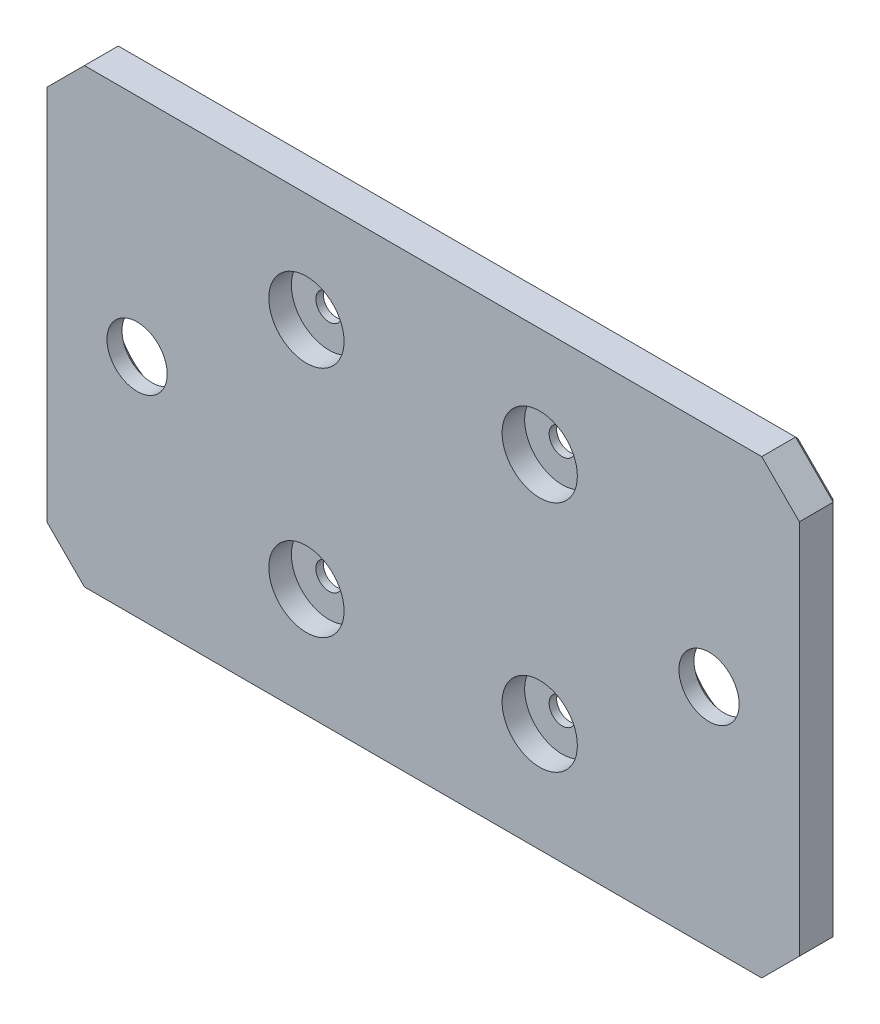
ISO-10303-21;
HEADER;
FILE_DESCRIPTION(('STEP AP214'),'2;1');
FILE_NAME('part.step','',(''),(''),'','','');
FILE_SCHEMA(('AUTOMOTIVE_DESIGN { 1 0 10303 214 1 1 1 1 }'));
ENDSEC;
DATA;
#1=APPLICATION_CONTEXT('core data for automotive mechanical design processes');
#2=APPLICATION_PROTOCOL_DEFINITION('international standard','automotive_design',2000,#1);
#3=PRODUCT_CONTEXT('',#1,'mechanical');
#4=PRODUCT('Part','Part','',(#3));
#5=PRODUCT_RELATED_PRODUCT_CATEGORY('part','',(#4));
#6=PRODUCT_DEFINITION_FORMATION('','',#4);
#7=PRODUCT_DEFINITION_CONTEXT('part definition',#1,'design');
#8=PRODUCT_DEFINITION('design','',#6,#7);
#9=PRODUCT_DEFINITION_SHAPE('','',#8);
#10=(LENGTH_UNIT() NAMED_UNIT(*) SI_UNIT(.MILLI.,.METRE.));
#11=(NAMED_UNIT(*) PLANE_ANGLE_UNIT() SI_UNIT($,.RADIAN.));
#12=(NAMED_UNIT(*) SI_UNIT($,.STERADIAN.) SOLID_ANGLE_UNIT());
#13=UNCERTAINTY_MEASURE_WITH_UNIT(LENGTH_MEASURE(1.E-05),#10,'distance_accuracy_value','');
#14=(GEOMETRIC_REPRESENTATION_CONTEXT(3) GLOBAL_UNCERTAINTY_ASSIGNED_CONTEXT((#13)) GLOBAL_UNIT_ASSIGNED_CONTEXT((#10,
#11,#12)) REPRESENTATION_CONTEXT('',''));
#15=CARTESIAN_POINT('',(0.,0.,0.));
#16=DIRECTION('',(0.,0.,1.));
#17=DIRECTION('',(1.,0.,0.));
#18=AXIS2_PLACEMENT_3D('',#15,#16,#17);
#19=CARTESIAN_POINT('',(-38.,0.,5.));
#20=DIRECTION('',(0.,0.,-1.));
#21=DIRECTION('',(-1.,0.,0.));
#22=AXIS2_PLACEMENT_3D('',#19,#20,#21);
#23=CYLINDRICAL_SURFACE('',#22,4.);
#24=CARTESIAN_POINT('',(-38.,0.,5.));
#25=DIRECTION('',(0.,0.,-1.));
#26=DIRECTION('',(-1.,0.,0.));
#27=AXIS2_PLACEMENT_3D('',#24,#25,#26);
#28=CIRCLE('',#27,4.);
#29=CARTESIAN_POINT('',(-42.,0.,5.));
#30=VERTEX_POINT('',#29);
#31=EDGE_CURVE('E234',#30,#30,#28,.T.);
#32=ORIENTED_EDGE('',*,*,#31,.F.);
#33=EDGE_LOOP('',(#32));
#34=FACE_BOUND('',#33,.T.);
#35=CARTESIAN_POINT('',(-38.,0.,3.));
#36=DIRECTION('',(0.,0.,-1.));
#37=DIRECTION('',(-1.,0.,0.));
#38=AXIS2_PLACEMENT_3D('',#35,#36,#37);
#39=CIRCLE('',#38,4.);
#40=CARTESIAN_POINT('',(-42.,0.,3.));
#41=VERTEX_POINT('',#40);
#42=EDGE_CURVE('E230',#41,#41,#39,.F.);
#43=ORIENTED_EDGE('',*,*,#42,.F.);
#44=EDGE_LOOP('',(#43));
#45=FACE_BOUND('',#44,.T.);
#46=ADVANCED_FACE('F39',(#34,#45),#23,.F.);
#47=CARTESIAN_POINT('',(38.,0.,5.));
#48=DIRECTION('',(0.,0.,-1.));
#49=DIRECTION('',(-1.,0.,0.));
#50=AXIS2_PLACEMENT_3D('',#47,#48,#49);
#51=CYLINDRICAL_SURFACE('',#50,4.00000000000001);
#52=CARTESIAN_POINT('',(38.,0.,5.));
#53=DIRECTION('',(0.,0.,-1.));
#54=DIRECTION('',(-1.,0.,0.));
#55=AXIS2_PLACEMENT_3D('',#52,#53,#54);
#56=CIRCLE('',#55,4.00000000000001);
#57=CARTESIAN_POINT('',(34.,0.,5.));
#58=VERTEX_POINT('',#57);
#59=EDGE_CURVE('E337',#58,#58,#56,.T.);
#60=ORIENTED_EDGE('',*,*,#59,.F.);
#61=EDGE_LOOP('',(#60));
#62=FACE_BOUND('',#61,.T.);
#63=CARTESIAN_POINT('',(38.,0.,3.));
#64=DIRECTION('',(0.,0.,-1.));
#65=DIRECTION('',(-1.,0.,0.));
#66=AXIS2_PLACEMENT_3D('',#63,#64,#65);
#67=CIRCLE('',#66,4.00000000000001);
#68=CARTESIAN_POINT('',(34.,0.,3.));
#69=VERTEX_POINT('',#68);
#70=EDGE_CURVE('E227',#69,#69,#67,.F.);
#71=ORIENTED_EDGE('',*,*,#70,.F.);
#72=EDGE_LOOP('',(#71));
#73=FACE_BOUND('',#72,.T.);
#74=ADVANCED_FACE('F408',(#62,#73),#51,.F.);
#75=CARTESIAN_POINT('',(-15.5,15.499999999999,-49.));
#76=DIRECTION('',(0.,0.,1.));
#77=DIRECTION('',(1.,0.,0.));
#78=AXIS2_PLACEMENT_3D('',#75,#76,#77);
#79=CYLINDRICAL_SURFACE('',#78,1.75);
#80=CARTESIAN_POINT('',(-15.5,15.499999999999,1.));
#81=DIRECTION('',(0.,0.,-1.));
#82=DIRECTION('',(-1.,0.,0.));
#83=AXIS2_PLACEMENT_3D('',#80,#81,#82);
#84=CIRCLE('',#83,1.75);
#85=CARTESIAN_POINT('',(-17.25,15.499999999999,1.));
#86=VERTEX_POINT('',#85);
#87=EDGE_CURVE('E197',#86,#86,#84,.T.);
#88=ORIENTED_EDGE('',*,*,#87,.T.);
#89=EDGE_LOOP('',(#88));
#90=FACE_BOUND('',#89,.T.);
#91=CARTESIAN_POINT('',(-15.5,15.499999999999,2.));
#92=DIRECTION('',(0.,0.,1.));
#93=DIRECTION('',(1.,0.,0.));
#94=AXIS2_PLACEMENT_3D('',#91,#92,#93);
#95=CIRCLE('',#94,1.75);
#96=CARTESIAN_POINT('',(-13.75,15.499999999999,2.));
#97=VERTEX_POINT('',#96);
#98=EDGE_CURVE('E202',#97,#97,#95,.F.);
#99=ORIENTED_EDGE('',*,*,#98,.F.);
#100=EDGE_LOOP('',(#99));
#101=FACE_BOUND('',#100,.T.);
#102=ADVANCED_FACE('F414',(#90,#101),#79,.F.);
#103=CARTESIAN_POINT('',(15.5,15.5,-49.));
#104=DIRECTION('',(0.,0.,1.));
#105=DIRECTION('',(1.,0.,0.));
#106=AXIS2_PLACEMENT_3D('',#103,#104,#105);
#107=CYLINDRICAL_SURFACE('',#106,1.75);
#108=CARTESIAN_POINT('',(15.5,15.5,1.));
#109=DIRECTION('',(0.,0.,-1.));
#110=DIRECTION('',(-1.,0.,0.));
#111=AXIS2_PLACEMENT_3D('',#108,#109,#110);
#112=CIRCLE('',#111,1.75);
#113=CARTESIAN_POINT('',(13.75,15.5,1.));
#114=VERTEX_POINT('',#113);
#115=EDGE_CURVE('E201',#114,#114,#112,.T.);
#116=ORIENTED_EDGE('',*,*,#115,.T.);
#117=EDGE_LOOP('',(#116));
#118=FACE_BOUND('',#117,.T.);
#119=CARTESIAN_POINT('',(15.5,15.5,2.));
#120=DIRECTION('',(0.,0.,1.));
#121=DIRECTION('',(1.,0.,0.));
#122=AXIS2_PLACEMENT_3D('',#119,#120,#121);
#123=CIRCLE('',#122,1.75);
#124=CARTESIAN_POINT('',(17.25,15.5,2.));
#125=VERTEX_POINT('',#124);
#126=EDGE_CURVE('E221',#125,#125,#123,.F.);
#127=ORIENTED_EDGE('',*,*,#126,.F.);
#128=EDGE_LOOP('',(#127));
#129=FACE_BOUND('',#128,.T.);
#130=ADVANCED_FACE('F454',(#118,#129),#107,.F.);
#131=CARTESIAN_POINT('',(15.4999999992762,-15.4999999996144,-49.));
#132=DIRECTION('',(0.,0.,1.));
#133=DIRECTION('',(1.,0.,0.));
#134=AXIS2_PLACEMENT_3D('',#131,#132,#133);
#135=CYLINDRICAL_SURFACE('',#134,1.75);
#136=CARTESIAN_POINT('',(15.4999999992762,-15.4999999996144,1.));
#137=DIRECTION('',(0.,0.,-1.));
#138=DIRECTION('',(-1.,0.,0.));
#139=AXIS2_PLACEMENT_3D('',#136,#137,#138);
#140=CIRCLE('',#139,1.75);
#141=CARTESIAN_POINT('',(13.7499999992762,-15.4999999996144,1.));
#142=VERTEX_POINT('',#141);
#143=EDGE_CURVE('E205',#142,#142,#140,.T.);
#144=ORIENTED_EDGE('',*,*,#143,.T.);
#145=EDGE_LOOP('',(#144));
#146=FACE_BOUND('',#145,.T.);
#147=CARTESIAN_POINT('',(15.4999999992762,-15.4999999996144,2.));
#148=DIRECTION('',(0.,0.,1.));
#149=DIRECTION('',(1.,0.,0.));
#150=AXIS2_PLACEMENT_3D('',#147,#148,#149);
#151=CIRCLE('',#150,1.75);
#152=CARTESIAN_POINT('',(17.2499999992762,-15.4999999996144,2.));
#153=VERTEX_POINT('',#152);
#154=EDGE_CURVE('E217',#153,#153,#151,.F.);
#155=ORIENTED_EDGE('',*,*,#154,.F.);
#156=EDGE_LOOP('',(#155));
#157=FACE_BOUND('',#156,.T.);
#158=ADVANCED_FACE('F401',(#146,#157),#135,.F.);
#159=CARTESIAN_POINT('',(-15.499999999999,-15.500000000001,-49.));
#160=DIRECTION('',(0.,0.,1.));
#161=DIRECTION('',(1.,0.,0.));
#162=AXIS2_PLACEMENT_3D('',#159,#160,#161);
#163=CYLINDRICAL_SURFACE('',#162,1.75);
#164=CARTESIAN_POINT('',(-15.499999999999,-15.500000000001,1.));
#165=DIRECTION('',(0.,0.,-1.));
#166=DIRECTION('',(-1.,0.,0.));
#167=AXIS2_PLACEMENT_3D('',#164,#165,#166);
#168=CIRCLE('',#167,1.75);
#169=CARTESIAN_POINT('',(-17.249999999999,-15.500000000001,1.));
#170=VERTEX_POINT('',#169);
#171=EDGE_CURVE('E208',#170,#170,#168,.T.);
#172=ORIENTED_EDGE('',*,*,#171,.T.);
#173=EDGE_LOOP('',(#172));
#174=FACE_BOUND('',#173,.T.);
#175=CARTESIAN_POINT('',(-15.499999999999,-15.500000000001,2.));
#176=DIRECTION('',(0.,0.,1.));
#177=DIRECTION('',(1.,0.,0.));
#178=AXIS2_PLACEMENT_3D('',#175,#176,#177);
#179=CIRCLE('',#178,1.75);
#180=CARTESIAN_POINT('',(-13.749999999999,-15.500000000001,2.));
#181=VERTEX_POINT('',#180);
#182=EDGE_CURVE('E213',#181,#181,#179,.F.);
#183=ORIENTED_EDGE('',*,*,#182,.F.);
#184=EDGE_LOOP('',(#183));
#185=FACE_BOUND('',#184,.T.);
#186=ADVANCED_FACE('F391',(#174,#185),#163,.F.);
#187=CARTESIAN_POINT('',(0.,0.,0.));
#188=DIRECTION('',(0.,0.,-1.));
#189=DIRECTION('',(-1.,0.,0.));
#190=AXIS2_PLACEMENT_3D('',#187,#188,#189);
#191=PLANE('',#190);
#192=DIRECTION('',(-1.,0.,0.));
#193=VECTOR('',#192,1.);
#194=CARTESIAN_POINT('',(-45.,-29.5,0.));
#195=LINE('',#194,#193);
#196=CARTESIAN_POINT('',(44.7928932188134,-29.5,0.));
#197=VERTEX_POINT('',#196);
#198=CARTESIAN_POINT('',(-44.7928932188135,-29.5,0.));
#199=VERTEX_POINT('',#198);
#200=EDGE_CURVE('E272',#197,#199,#195,.T.);
#201=ORIENTED_EDGE('',*,*,#200,.T.);
#202=DIRECTION('',(-0.707106781186547,0.707106781186549,0.));
#203=VECTOR('',#202,1.);
#204=CARTESIAN_POINT('',(-37.1464466094068,-37.1464466094067,0.));
#205=LINE('',#204,#203);
#206=CARTESIAN_POINT('',(-49.5,-24.7928932188135,0.));
#207=VERTEX_POINT('',#206);
#208=EDGE_CURVE('E286',#199,#207,#205,.T.);
#209=ORIENTED_EDGE('',*,*,#208,.T.);
#210=DIRECTION('',(0.,1.,0.));
#211=VECTOR('',#210,1.);
#212=CARTESIAN_POINT('',(-49.5,25.,0.));
#213=LINE('',#212,#211);
#214=CARTESIAN_POINT('',(-49.5,24.7928932188134,0.));
#215=VERTEX_POINT('',#214);
#216=EDGE_CURVE('E284',#207,#215,#213,.T.);
#217=ORIENTED_EDGE('',*,*,#216,.T.);
#218=DIRECTION('',(0.70710678118655,0.707106781186546,0.));
#219=VECTOR('',#218,1.);
#220=CARTESIAN_POINT('',(-37.1464466094066,37.1464466094068,0.));
#221=LINE('',#220,#219);
#222=CARTESIAN_POINT('',(-44.7928932188134,29.5,0.));
#223=VERTEX_POINT('',#222);
#224=EDGE_CURVE('E282',#215,#223,#221,.T.);
#225=ORIENTED_EDGE('',*,*,#224,.T.);
#226=DIRECTION('',(1.,0.,0.));
#227=VECTOR('',#226,1.);
#228=CARTESIAN_POINT('',(45.,29.5,0.));
#229=LINE('',#228,#227);
#230=CARTESIAN_POINT('',(44.7928932188135,29.5,0.));
#231=VERTEX_POINT('',#230);
#232=EDGE_CURVE('E280',#223,#231,#229,.T.);
#233=ORIENTED_EDGE('',*,*,#232,.T.);
#234=DIRECTION('',(0.707106781186547,-0.707106781186549,0.));
#235=VECTOR('',#234,1.);
#236=CARTESIAN_POINT('',(37.1464466094068,37.1464466094067,0.));
#237=LINE('',#236,#235);
#238=CARTESIAN_POINT('',(49.5,24.7928932188134,0.));
#239=VERTEX_POINT('',#238);
#240=EDGE_CURVE('E278',#231,#239,#237,.T.);
#241=ORIENTED_EDGE('',*,*,#240,.T.);
#242=DIRECTION('',(0.,-1.,0.));
#243=VECTOR('',#242,1.);
#244=CARTESIAN_POINT('',(49.5,-25.,0.));
#245=LINE('',#244,#243);
#246=CARTESIAN_POINT('',(49.5,-24.7928932188135,0.));
#247=VERTEX_POINT('',#246);
#248=EDGE_CURVE('E276',#239,#247,#245,.T.);
#249=ORIENTED_EDGE('',*,*,#248,.T.);
#250=DIRECTION('',(-0.70710678118655,-0.707106781186546,0.));
#251=VECTOR('',#250,1.);
#252=CARTESIAN_POINT('',(37.1464466094066,-37.1464466094068,0.));
#253=LINE('',#252,#251);
#254=EDGE_CURVE('E274',#247,#197,#253,.T.);
#255=ORIENTED_EDGE('',*,*,#254,.T.);
#256=EDGE_LOOP('',(#201,#209,#217,#225,#233,#241,#249,#255));
#257=FACE_BOUND('',#256,.T.);
#258=CARTESIAN_POINT('',(-38.,0.,0.));
#259=DIRECTION('',(0.,0.,-1.));
#260=DIRECTION('',(-1.,0.,0.));
#261=AXIS2_PLACEMENT_3D('',#258,#259,#260);
#262=CIRCLE('',#261,8.00000000000002);
#263=CARTESIAN_POINT('',(-46.,0.,0.));
#264=VERTEX_POINT('',#263);
#265=EDGE_CURVE('E240',#264,#264,#262,.F.);
#266=ORIENTED_EDGE('',*,*,#265,.T.);
#267=EDGE_LOOP('',(#266));
#268=FACE_BOUND('',#267,.T.);
#269=CARTESIAN_POINT('',(38.,0.,0.));
#270=DIRECTION('',(0.,0.,-1.));
#271=DIRECTION('',(-1.,0.,0.));
#272=AXIS2_PLACEMENT_3D('',#269,#270,#271);
#273=CIRCLE('',#272,8.00000000000002);
#274=CARTESIAN_POINT('',(30.,0.,0.));
#275=VERTEX_POINT('',#274);
#276=EDGE_CURVE('E237',#275,#275,#273,.F.);
#277=ORIENTED_EDGE('',*,*,#276,.T.);
#278=EDGE_LOOP('',(#277));
#279=FACE_BOUND('',#278,.T.);
#280=DIRECTION('',(-1.,0.,0.));
#281=VECTOR('',#280,1.);
#282=CARTESIAN_POINT('',(21.75,21.75,0.));
#283=LINE('',#282,#281);
#284=CARTESIAN_POINT('',(21.75,21.75,0.));
#285=VERTEX_POINT('',#284);
#286=CARTESIAN_POINT('',(-21.75,21.75,0.));
#287=VERTEX_POINT('',#286);
#288=EDGE_CURVE('E173',#285,#287,#283,.T.);
#289=ORIENTED_EDGE('',*,*,#288,.T.);
#290=DIRECTION('',(0.,-1.,0.));
#291=VECTOR('',#290,1.);
#292=CARTESIAN_POINT('',(-21.75,21.75,0.));
#293=LINE('',#292,#291);
#294=CARTESIAN_POINT('',(-21.75,-21.75,0.));
#295=VERTEX_POINT('',#294);
#296=EDGE_CURVE('E212',#287,#295,#293,.T.);
#297=ORIENTED_EDGE('',*,*,#296,.T.);
#298=DIRECTION('',(1.,0.,0.));
#299=VECTOR('',#298,1.);
#300=CARTESIAN_POINT('',(21.75,-21.75,0.));
#301=LINE('',#300,#299);
#302=CARTESIAN_POINT('',(21.75,-21.75,0.));
#303=VERTEX_POINT('',#302);
#304=EDGE_CURVE('E177',#295,#303,#301,.T.);
#305=ORIENTED_EDGE('',*,*,#304,.T.);
#306=DIRECTION('',(0.,1.,0.));
#307=VECTOR('',#306,1.);
#308=CARTESIAN_POINT('',(21.75,21.75,0.));
#309=LINE('',#308,#307);
#310=EDGE_CURVE('E375',#303,#285,#309,.T.);
#311=ORIENTED_EDGE('',*,*,#310,.T.);
#312=EDGE_LOOP('',(#289,#297,#305,#311));
#313=FACE_BOUND('',#312,.T.);
#314=ADVANCED_FACE('F388',(#257,#268,#279,#313),#191,.T.);
#315=CARTESIAN_POINT('',(50.,-30.,5.));
#316=DIRECTION('',(-1.,0.,0.));
#317=DIRECTION('',(0.,0.,1.));
#318=AXIS2_PLACEMENT_3D('',#315,#316,#317);
#319=PLANE('',#318);
#320=DIRECTION('',(0.,0.,-1.));
#321=VECTOR('',#320,1.);
#322=CARTESIAN_POINT('',(50.,-25.,5.));
#323=LINE('',#322,#321);
#324=CARTESIAN_POINT('',(50.,-25.,5.));
#325=VERTEX_POINT('',#324);
#326=CARTESIAN_POINT('',(50.,-25.,0.500000000000013));
#327=VERTEX_POINT('',#326);
#328=EDGE_CURVE('E251',#325,#327,#323,.T.);
#329=ORIENTED_EDGE('',*,*,#328,.T.);
#330=DIRECTION('',(0.,1.,0.));
#331=VECTOR('',#330,1.);
#332=CARTESIAN_POINT('',(50.,25.,0.500000000000014));
#333=LINE('',#332,#331);
#334=CARTESIAN_POINT('',(50.,25.,0.500000000000014));
#335=VERTEX_POINT('',#334);
#336=EDGE_CURVE('E300',#327,#335,#333,.T.);
#337=ORIENTED_EDGE('',*,*,#336,.T.);
#338=DIRECTION('',(0.,0.,1.));
#339=VECTOR('',#338,1.);
#340=CARTESIAN_POINT('',(50.,25.,5.));
#341=LINE('',#340,#339);
#342=CARTESIAN_POINT('',(50.,25.,5.));
#343=VERTEX_POINT('',#342);
#344=EDGE_CURVE('E253',#335,#343,#341,.T.);
#345=ORIENTED_EDGE('',*,*,#344,.T.);
#346=DIRECTION('',(0.,1.,0.));
#347=VECTOR('',#346,1.);
#348=CARTESIAN_POINT('',(50.,-30.,5.));
#349=LINE('',#348,#347);
#350=EDGE_CURVE('E178',#325,#343,#349,.T.);
#351=ORIENTED_EDGE('',*,*,#350,.F.);
#352=EDGE_LOOP('',(#329,#337,#345,#351));
#353=FACE_BOUND('',#352,.T.);
#354=ADVANCED_FACE('F390',(#353),#319,.F.);
#355=CARTESIAN_POINT('',(-50.,30.,5.));
#356=DIRECTION('',(0.,-1.,0.));
#357=DIRECTION('',(0.,0.,-1.));
#358=AXIS2_PLACEMENT_3D('',#355,#356,#357);
#359=PLANE('',#358);
#360=DIRECTION('',(0.,0.,-1.));
#361=VECTOR('',#360,1.);
#362=CARTESIAN_POINT('',(45.,30.,5.));
#363=LINE('',#362,#361);
#364=CARTESIAN_POINT('',(45.,30.,5.));
#365=VERTEX_POINT('',#364);
#366=CARTESIAN_POINT('',(45.,30.,0.500000000000015));
#367=VERTEX_POINT('',#366);
#368=EDGE_CURVE('E248',#365,#367,#363,.T.);
#369=ORIENTED_EDGE('',*,*,#368,.T.);
#370=DIRECTION('',(-1.,0.,0.));
#371=VECTOR('',#370,1.);
#372=CARTESIAN_POINT('',(-45.,30.,0.500000000000014));
#373=LINE('',#372,#371);
#374=CARTESIAN_POINT('',(-45.,30.,0.500000000000014));
#375=VERTEX_POINT('',#374);
#376=EDGE_CURVE('E296',#367,#375,#373,.T.);
#377=ORIENTED_EDGE('',*,*,#376,.T.);
#378=DIRECTION('',(0.,0.,1.));
#379=VECTOR('',#378,1.);
#380=CARTESIAN_POINT('',(-45.,30.,5.));
#381=LINE('',#380,#379);
#382=CARTESIAN_POINT('',(-45.,30.,5.));
#383=VERTEX_POINT('',#382);
#384=EDGE_CURVE('E246',#375,#383,#381,.T.);
#385=ORIENTED_EDGE('',*,*,#384,.T.);
#386=DIRECTION('',(-1.,0.,0.));
#387=VECTOR('',#386,1.);
#388=CARTESIAN_POINT('',(-50.,30.,5.));
#389=LINE('',#388,#387);
#390=EDGE_CURVE('E182',#365,#383,#389,.T.);
#391=ORIENTED_EDGE('',*,*,#390,.F.);
#392=EDGE_LOOP('',(#369,#377,#385,#391));
#393=FACE_BOUND('',#392,.T.);
#394=ADVANCED_FACE('F398',(#393),#359,.F.);
#395=CARTESIAN_POINT('',(-50.,-30.,5.));
#396=DIRECTION('',(1.,0.,0.));
#397=DIRECTION('',(0.,0.,-1.));
#398=AXIS2_PLACEMENT_3D('',#395,#396,#397);
#399=PLANE('',#398);
#400=DIRECTION('',(0.,0.,-1.));
#401=VECTOR('',#400,1.);
#402=CARTESIAN_POINT('',(-50.,25.,5.));
#403=LINE('',#402,#401);
#404=CARTESIAN_POINT('',(-50.,25.,5.));
#405=VERTEX_POINT('',#404);
#406=CARTESIAN_POINT('',(-50.,25.,0.500000000000013));
#407=VERTEX_POINT('',#406);
#408=EDGE_CURVE('E265',#405,#407,#403,.T.);
#409=ORIENTED_EDGE('',*,*,#408,.T.);
#410=DIRECTION('',(0.,-1.,0.));
#411=VECTOR('',#410,1.);
#412=CARTESIAN_POINT('',(-50.,-25.,0.500000000000014));
#413=LINE('',#412,#411);
#414=CARTESIAN_POINT('',(-50.,-25.,0.500000000000014));
#415=VERTEX_POINT('',#414);
#416=EDGE_CURVE('E292',#407,#415,#413,.T.);
#417=ORIENTED_EDGE('',*,*,#416,.T.);
#418=DIRECTION('',(0.,0.,1.));
#419=VECTOR('',#418,1.);
#420=CARTESIAN_POINT('',(-50.,-25.,5.));
#421=LINE('',#420,#419);
#422=CARTESIAN_POINT('',(-50.,-25.,5.));
#423=VERTEX_POINT('',#422);
#424=EDGE_CURVE('E263',#415,#423,#421,.T.);
#425=ORIENTED_EDGE('',*,*,#424,.T.);
#426=DIRECTION('',(0.,-1.,0.));
#427=VECTOR('',#426,1.);
#428=CARTESIAN_POINT('',(-50.,-30.,5.));
#429=LINE('',#428,#427);
#430=EDGE_CURVE('E190',#405,#423,#429,.T.);
#431=ORIENTED_EDGE('',*,*,#430,.F.);
#432=EDGE_LOOP('',(#409,#417,#425,#431));
#433=FACE_BOUND('',#432,.T.);
#434=ADVANCED_FACE('F481',(#433),#399,.F.);
#435=CARTESIAN_POINT('',(-50.,-30.,5.));
#436=DIRECTION('',(0.,1.,0.));
#437=DIRECTION('',(0.,0.,1.));
#438=AXIS2_PLACEMENT_3D('',#435,#436,#437);
#439=PLANE('',#438);
#440=DIRECTION('',(0.,0.,-1.));
#441=VECTOR('',#440,1.);
#442=CARTESIAN_POINT('',(-45.,-30.,5.));
#443=LINE('',#442,#441);
#444=CARTESIAN_POINT('',(-45.,-30.,5.));
#445=VERTEX_POINT('',#444);
#446=CARTESIAN_POINT('',(-45.,-30.,0.500000000000014));
#447=VERTEX_POINT('',#446);
#448=EDGE_CURVE('E270',#445,#447,#443,.T.);
#449=ORIENTED_EDGE('',*,*,#448,.T.);
#450=DIRECTION('',(1.,0.,0.));
#451=VECTOR('',#450,1.);
#452=CARTESIAN_POINT('',(45.,-30.,0.500000000000014));
#453=LINE('',#452,#451);
#454=CARTESIAN_POINT('',(45.,-30.,0.500000000000014));
#455=VERTEX_POINT('',#454);
#456=EDGE_CURVE('E11',#447,#455,#453,.T.);
#457=ORIENTED_EDGE('',*,*,#456,.T.);
#458=DIRECTION('',(0.,0.,1.));
#459=VECTOR('',#458,1.);
#460=CARTESIAN_POINT('',(45.,-30.,5.));
#461=LINE('',#460,#459);
#462=CARTESIAN_POINT('',(45.,-30.,5.));
#463=VERTEX_POINT('',#462);
#464=EDGE_CURVE('E268',#455,#463,#461,.T.);
#465=ORIENTED_EDGE('',*,*,#464,.T.);
#466=DIRECTION('',(1.,0.,0.));
#467=VECTOR('',#466,1.);
#468=CARTESIAN_POINT('',(-50.,-30.,5.));
#469=LINE('',#468,#467);
#470=EDGE_CURVE('E193',#445,#463,#469,.T.);
#471=ORIENTED_EDGE('',*,*,#470,.F.);
#472=EDGE_LOOP('',(#449,#457,#465,#471));
#473=FACE_BOUND('',#472,.T.);
#474=ADVANCED_FACE('F476',(#473),#439,.F.);
#475=CARTESIAN_POINT('',(0.,0.,5.));
#476=DIRECTION('',(0.,0.,-1.));
#477=DIRECTION('',(-1.,0.,0.));
#478=AXIS2_PLACEMENT_3D('',#475,#476,#477);
#479=PLANE('',#478);
#480=ORIENTED_EDGE('',*,*,#59,.T.);
#481=EDGE_LOOP('',(#480));
#482=FACE_BOUND('',#481,.T.);
#483=ORIENTED_EDGE('',*,*,#31,.T.);
#484=EDGE_LOOP('',(#483));
#485=FACE_BOUND('',#484,.T.);
#486=CARTESIAN_POINT('',(-15.499999999999,-15.500000000001,5.));
#487=DIRECTION('',(0.,0.,1.));
#488=DIRECTION('',(1.,0.,0.));
#489=AXIS2_PLACEMENT_3D('',#486,#487,#488);
#490=CIRCLE('',#489,5.);
#491=CARTESIAN_POINT('',(-10.499999999999,-15.500000000001,5.));
#492=VERTEX_POINT('',#491);
#493=EDGE_CURVE('E340',#492,#492,#490,.T.);
#494=ORIENTED_EDGE('',*,*,#493,.F.);
#495=EDGE_LOOP('',(#494));
#496=FACE_BOUND('',#495,.T.);
#497=CARTESIAN_POINT('',(15.4999999992762,-15.4999999996144,5.));
#498=DIRECTION('',(0.,0.,1.));
#499=DIRECTION('',(1.,0.,0.));
#500=AXIS2_PLACEMENT_3D('',#497,#498,#499);
#501=CIRCLE('',#500,5.);
#502=CARTESIAN_POINT('',(20.4999999992762,-15.4999999996144,5.));
#503=VERTEX_POINT('',#502);
#504=EDGE_CURVE('E353',#503,#503,#501,.T.);
#505=ORIENTED_EDGE('',*,*,#504,.F.);
#506=EDGE_LOOP('',(#505));
#507=FACE_BOUND('',#506,.T.);
#508=CARTESIAN_POINT('',(15.5,15.5,5.));
#509=DIRECTION('',(0.,0.,1.));
#510=DIRECTION('',(1.,0.,0.));
#511=AXIS2_PLACEMENT_3D('',#508,#509,#510);
#512=CIRCLE('',#511,5.);
#513=CARTESIAN_POINT('',(20.5,15.5,5.));
#514=VERTEX_POINT('',#513);
#515=EDGE_CURVE('E347',#514,#514,#512,.T.);
#516=ORIENTED_EDGE('',*,*,#515,.F.);
#517=EDGE_LOOP('',(#516));
#518=FACE_BOUND('',#517,.T.);
#519=CARTESIAN_POINT('',(-15.5,15.499999999999,5.));
#520=DIRECTION('',(0.,0.,1.));
#521=DIRECTION('',(1.,0.,0.));
#522=AXIS2_PLACEMENT_3D('',#519,#520,#521);
#523=CIRCLE('',#522,5.);
#524=CARTESIAN_POINT('',(-10.5,15.499999999999,5.));
#525=VERTEX_POINT('',#524);
#526=EDGE_CURVE('E346',#525,#525,#523,.T.);
#527=ORIENTED_EDGE('',*,*,#526,.F.);
#528=EDGE_LOOP('',(#527));
#529=FACE_BOUND('',#528,.T.);
#530=ORIENTED_EDGE('',*,*,#350,.T.);
#531=DIRECTION('',(0.707106781186547,-0.707106781186549,0.));
#532=VECTOR('',#531,1.);
#533=CARTESIAN_POINT('',(45.,30.,5.));
#534=LINE('',#533,#532);
#535=EDGE_CURVE('E261',#343,#365,#534,.F.);
#536=ORIENTED_EDGE('',*,*,#535,.T.);
#537=ORIENTED_EDGE('',*,*,#390,.T.);
#538=DIRECTION('',(0.70710678118655,0.707106781186546,0.));
#539=VECTOR('',#538,1.);
#540=CARTESIAN_POINT('',(-50.,25.,5.));
#541=LINE('',#540,#539);
#542=EDGE_CURVE('E259',#383,#405,#541,.F.);
#543=ORIENTED_EDGE('',*,*,#542,.T.);
#544=ORIENTED_EDGE('',*,*,#430,.T.);
#545=DIRECTION('',(-0.707106781186547,0.707106781186549,0.));
#546=VECTOR('',#545,1.);
#547=CARTESIAN_POINT('',(-45.,-30.,5.));
#548=LINE('',#547,#546);
#549=EDGE_CURVE('E257',#423,#445,#548,.F.);
#550=ORIENTED_EDGE('',*,*,#549,.T.);
#551=ORIENTED_EDGE('',*,*,#470,.T.);
#552=DIRECTION('',(-0.70710678118655,-0.707106781186546,0.));
#553=VECTOR('',#552,1.);
#554=CARTESIAN_POINT('',(50.,-25.,5.));
#555=LINE('',#554,#553);
#556=EDGE_CURVE('E255',#463,#325,#555,.F.);
#557=ORIENTED_EDGE('',*,*,#556,.T.);
#558=EDGE_LOOP('',(#530,#536,#537,#543,#544,#550,#551,#557));
#559=FACE_BOUND('',#558,.T.);
#560=ADVANCED_FACE('F474',(#482,#485,#496,#507,#518,#529,#559),#479,.F.);
#561=CARTESIAN_POINT('',(-21.75,21.75,1.));
#562=DIRECTION('',(1.,0.,0.));
#563=DIRECTION('',(0.,1.,0.));
#564=AXIS2_PLACEMENT_3D('',#561,#562,#563);
#565=PLANE('',#564);
#566=ORIENTED_EDGE('',*,*,#296,.F.);
#567=DIRECTION('',(0.,0.,-1.));
#568=VECTOR('',#567,1.);
#569=CARTESIAN_POINT('',(-21.75,21.75,1.));
#570=LINE('',#569,#568);
#571=CARTESIAN_POINT('',(-21.75,21.75,1.));
#572=VERTEX_POINT('',#571);
#573=EDGE_CURVE('E171',#572,#287,#570,.T.);
#574=ORIENTED_EDGE('',*,*,#573,.F.);
#575=DIRECTION('',(0.,-1.,0.));
#576=VECTOR('',#575,1.);
#577=CARTESIAN_POINT('',(-21.75,21.75,1.));
#578=LINE('',#577,#576);
#579=CARTESIAN_POINT('',(-21.75,-21.75,1.));
#580=VERTEX_POINT('',#579);
#581=EDGE_CURVE('E158',#572,#580,#578,.T.);
#582=ORIENTED_EDGE('',*,*,#581,.T.);
#583=DIRECTION('',(0.,0.,-1.));
#584=VECTOR('',#583,1.);
#585=CARTESIAN_POINT('',(-21.75,-21.75,1.));
#586=LINE('',#585,#584);
#587=EDGE_CURVE('E168',#580,#295,#586,.T.);
#588=ORIENTED_EDGE('',*,*,#587,.T.);
#589=EDGE_LOOP('',(#566,#574,#582,#588));
#590=FACE_BOUND('',#589,.T.);
#591=ADVANCED_FACE('F167',(#590),#565,.T.);
#592=CARTESIAN_POINT('',(21.75,-21.75,1.));
#593=DIRECTION('',(0.,1.,0.));
#594=DIRECTION('',(-1.,0.,0.));
#595=AXIS2_PLACEMENT_3D('',#592,#593,#594);
#596=PLANE('',#595);
#597=ORIENTED_EDGE('',*,*,#304,.F.);
#598=ORIENTED_EDGE('',*,*,#587,.F.);
#599=DIRECTION('',(1.,0.,0.));
#600=VECTOR('',#599,1.);
#601=CARTESIAN_POINT('',(21.75,-21.75,1.));
#602=LINE('',#601,#600);
#603=CARTESIAN_POINT('',(21.75,-21.75,1.));
#604=VERTEX_POINT('',#603);
#605=EDGE_CURVE('E154',#580,#604,#602,.T.);
#606=ORIENTED_EDGE('',*,*,#605,.T.);
#607=DIRECTION('',(0.,0.,-1.));
#608=VECTOR('',#607,1.);
#609=CARTESIAN_POINT('',(21.75,-21.75,1.));
#610=LINE('',#609,#608);
#611=EDGE_CURVE('E179',#604,#303,#610,.T.);
#612=ORIENTED_EDGE('',*,*,#611,.T.);
#613=EDGE_LOOP('',(#597,#598,#606,#612));
#614=FACE_BOUND('',#613,.T.);
#615=ADVANCED_FACE('F175',(#614),#596,.T.);
#616=CARTESIAN_POINT('',(21.75,21.75,1.));
#617=DIRECTION('',(-1.,0.,0.));
#618=DIRECTION('',(0.,-1.,0.));
#619=AXIS2_PLACEMENT_3D('',#616,#617,#618);
#620=PLANE('',#619);
#621=ORIENTED_EDGE('',*,*,#310,.F.);
#622=ORIENTED_EDGE('',*,*,#611,.F.);
#623=DIRECTION('',(0.,1.,0.));
#624=VECTOR('',#623,1.);
#625=CARTESIAN_POINT('',(21.75,21.75,1.));
#626=LINE('',#625,#624);
#627=CARTESIAN_POINT('',(21.75,21.75,1.));
#628=VERTEX_POINT('',#627);
#629=EDGE_CURVE('E159',#604,#628,#626,.T.);
#630=ORIENTED_EDGE('',*,*,#629,.T.);
#631=DIRECTION('',(0.,0.,-1.));
#632=VECTOR('',#631,1.);
#633=CARTESIAN_POINT('',(21.75,21.75,1.));
#634=LINE('',#633,#632);
#635=EDGE_CURVE('E184',#628,#285,#634,.T.);
#636=ORIENTED_EDGE('',*,*,#635,.T.);
#637=EDGE_LOOP('',(#621,#622,#630,#636));
#638=FACE_BOUND('',#637,.T.);
#639=ADVANCED_FACE('F384',(#638),#620,.T.);
#640=CARTESIAN_POINT('',(21.75,21.75,1.));
#641=DIRECTION('',(0.,-1.,0.));
#642=DIRECTION('',(1.,0.,0.));
#643=AXIS2_PLACEMENT_3D('',#640,#641,#642);
#644=PLANE('',#643);
#645=ORIENTED_EDGE('',*,*,#288,.F.);
#646=ORIENTED_EDGE('',*,*,#635,.F.);
#647=DIRECTION('',(-1.,0.,0.));
#648=VECTOR('',#647,1.);
#649=CARTESIAN_POINT('',(21.75,21.75,1.));
#650=LINE('',#649,#648);
#651=EDGE_CURVE('E370',#628,#572,#650,.T.);
#652=ORIENTED_EDGE('',*,*,#651,.T.);
#653=ORIENTED_EDGE('',*,*,#573,.T.);
#654=EDGE_LOOP('',(#645,#646,#652,#653));
#655=FACE_BOUND('',#654,.T.);
#656=ADVANCED_FACE('F386',(#655),#644,.T.);
#657=CARTESIAN_POINT('',(0.,0.,1.));
#658=DIRECTION('',(0.,0.,-1.));
#659=DIRECTION('',(-1.,0.,0.));
#660=AXIS2_PLACEMENT_3D('',#657,#658,#659);
#661=PLANE('',#660);
#662=ORIENTED_EDGE('',*,*,#171,.F.);
#663=EDGE_LOOP('',(#662));
#664=FACE_BOUND('',#663,.T.);
#665=ORIENTED_EDGE('',*,*,#143,.F.);
#666=EDGE_LOOP('',(#665));
#667=FACE_BOUND('',#666,.T.);
#668=ORIENTED_EDGE('',*,*,#115,.F.);
#669=EDGE_LOOP('',(#668));
#670=FACE_BOUND('',#669,.T.);
#671=ORIENTED_EDGE('',*,*,#87,.F.);
#672=EDGE_LOOP('',(#671));
#673=FACE_BOUND('',#672,.T.);
#674=ORIENTED_EDGE('',*,*,#581,.F.);
#675=ORIENTED_EDGE('',*,*,#651,.F.);
#676=ORIENTED_EDGE('',*,*,#629,.F.);
#677=ORIENTED_EDGE('',*,*,#605,.F.);
#678=EDGE_LOOP('',(#674,#675,#676,#677));
#679=FACE_BOUND('',#678,.T.);
#680=ADVANCED_FACE('F156',(#664,#667,#670,#673,#679),#661,.T.);
#681=CARTESIAN_POINT('',(-15.499999999999,-15.500000000001,2.));
#682=DIRECTION('',(0.,0.,1.));
#683=DIRECTION('',(1.,0.,0.));
#684=AXIS2_PLACEMENT_3D('',#681,#682,#683);
#685=PLANE('',#684);
#686=CARTESIAN_POINT('',(-15.499999999999,-15.500000000001,2.));
#687=DIRECTION('',(0.,0.,1.));
#688=DIRECTION('',(1.,0.,0.));
#689=AXIS2_PLACEMENT_3D('',#686,#687,#688);
#690=CIRCLE('',#689,5.);
#691=CARTESIAN_POINT('',(-10.499999999999,-15.500000000001,2.));
#692=VERTEX_POINT('',#691);
#693=EDGE_CURVE('E356',#692,#692,#690,.T.);
#694=ORIENTED_EDGE('',*,*,#693,.T.);
#695=EDGE_LOOP('',(#694));
#696=FACE_BOUND('',#695,.T.);
#697=ORIENTED_EDGE('',*,*,#182,.T.);
#698=EDGE_LOOP('',(#697));
#699=FACE_BOUND('',#698,.T.);
#700=ADVANCED_FACE('F439',(#696,#699),#685,.T.);
#701=CARTESIAN_POINT('',(-15.499999999999,-15.500000000001,2.));
#702=DIRECTION('',(0.,0.,1.));
#703=DIRECTION('',(1.,0.,0.));
#704=AXIS2_PLACEMENT_3D('',#701,#702,#703);
#705=CYLINDRICAL_SURFACE('',#704,5.);
#706=ORIENTED_EDGE('',*,*,#693,.F.);
#707=EDGE_LOOP('',(#706));
#708=FACE_BOUND('',#707,.T.);
#709=ORIENTED_EDGE('',*,*,#493,.T.);
#710=EDGE_LOOP('',(#709));
#711=FACE_BOUND('',#710,.T.);
#712=ADVANCED_FACE('F434',(#708,#711),#705,.F.);
#713=CARTESIAN_POINT('',(15.4999999992762,-15.4999999996144,2.));
#714=DIRECTION('',(0.,0.,1.));
#715=DIRECTION('',(1.,0.,0.));
#716=AXIS2_PLACEMENT_3D('',#713,#714,#715);
#717=PLANE('',#716);
#718=CARTESIAN_POINT('',(15.4999999992762,-15.4999999996144,2.));
#719=DIRECTION('',(0.,0.,1.));
#720=DIRECTION('',(1.,0.,0.));
#721=AXIS2_PLACEMENT_3D('',#718,#719,#720);
#722=CIRCLE('',#721,5.);
#723=CARTESIAN_POINT('',(20.4999999992762,-15.4999999996144,2.));
#724=VERTEX_POINT('',#723);
#725=EDGE_CURVE('E350',#724,#724,#722,.T.);
#726=ORIENTED_EDGE('',*,*,#725,.T.);
#727=EDGE_LOOP('',(#726));
#728=FACE_BOUND('',#727,.T.);
#729=ORIENTED_EDGE('',*,*,#154,.T.);
#730=EDGE_LOOP('',(#729));
#731=FACE_BOUND('',#730,.T.);
#732=ADVANCED_FACE('F431',(#728,#731),#717,.T.);
#733=CARTESIAN_POINT('',(15.4999999992762,-15.4999999996144,2.));
#734=DIRECTION('',(0.,0.,1.));
#735=DIRECTION('',(1.,0.,0.));
#736=AXIS2_PLACEMENT_3D('',#733,#734,#735);
#737=CYLINDRICAL_SURFACE('',#736,5.);
#738=ORIENTED_EDGE('',*,*,#725,.F.);
#739=EDGE_LOOP('',(#738));
#740=FACE_BOUND('',#739,.T.);
#741=ORIENTED_EDGE('',*,*,#504,.T.);
#742=EDGE_LOOP('',(#741));
#743=FACE_BOUND('',#742,.T.);
#744=ADVANCED_FACE('F425',(#740,#743),#737,.F.);
#745=CARTESIAN_POINT('',(15.5,15.5,2.));
#746=DIRECTION('',(0.,0.,1.));
#747=DIRECTION('',(1.,0.,0.));
#748=AXIS2_PLACEMENT_3D('',#745,#746,#747);
#749=PLANE('',#748);
#750=CARTESIAN_POINT('',(15.5,15.5,2.));
#751=DIRECTION('',(0.,0.,1.));
#752=DIRECTION('',(1.,0.,0.));
#753=AXIS2_PLACEMENT_3D('',#750,#751,#752);
#754=CIRCLE('',#753,5.);
#755=CARTESIAN_POINT('',(20.5,15.5,2.));
#756=VERTEX_POINT('',#755);
#757=EDGE_CURVE('E343',#756,#756,#754,.T.);
#758=ORIENTED_EDGE('',*,*,#757,.T.);
#759=EDGE_LOOP('',(#758));
#760=FACE_BOUND('',#759,.T.);
#761=ORIENTED_EDGE('',*,*,#126,.T.);
#762=EDGE_LOOP('',(#761));
#763=FACE_BOUND('',#762,.T.);
#764=ADVANCED_FACE('F421',(#760,#763),#749,.T.);
#765=CARTESIAN_POINT('',(15.5,15.5,2.));
#766=DIRECTION('',(0.,0.,1.));
#767=DIRECTION('',(1.,0.,0.));
#768=AXIS2_PLACEMENT_3D('',#765,#766,#767);
#769=CYLINDRICAL_SURFACE('',#768,5.);
#770=ORIENTED_EDGE('',*,*,#757,.F.);
#771=EDGE_LOOP('',(#770));
#772=FACE_BOUND('',#771,.T.);
#773=ORIENTED_EDGE('',*,*,#515,.T.);
#774=EDGE_LOOP('',(#773));
#775=FACE_BOUND('',#774,.T.);
#776=ADVANCED_FACE('F424',(#772,#775),#769,.F.);
#777=CARTESIAN_POINT('',(-15.5,15.499999999999,2.));
#778=DIRECTION('',(0.,0.,1.));
#779=DIRECTION('',(1.,0.,0.));
#780=AXIS2_PLACEMENT_3D('',#777,#778,#779);
#781=PLANE('',#780);
#782=CARTESIAN_POINT('',(-15.5,15.499999999999,2.));
#783=DIRECTION('',(0.,0.,1.));
#784=DIRECTION('',(1.,0.,0.));
#785=AXIS2_PLACEMENT_3D('',#782,#783,#784);
#786=CIRCLE('',#785,5.);
#787=CARTESIAN_POINT('',(-10.5,15.499999999999,2.));
#788=VERTEX_POINT('',#787);
#789=EDGE_CURVE('E218',#788,#788,#786,.T.);
#790=ORIENTED_EDGE('',*,*,#789,.T.);
#791=EDGE_LOOP('',(#790));
#792=FACE_BOUND('',#791,.T.);
#793=ORIENTED_EDGE('',*,*,#98,.T.);
#794=EDGE_LOOP('',(#793));
#795=FACE_BOUND('',#794,.T.);
#796=ADVANCED_FACE('F429',(#792,#795),#781,.T.);
#797=CARTESIAN_POINT('',(-15.5,15.499999999999,2.));
#798=DIRECTION('',(0.,0.,1.));
#799=DIRECTION('',(1.,0.,0.));
#800=AXIS2_PLACEMENT_3D('',#797,#798,#799);
#801=CYLINDRICAL_SURFACE('',#800,5.);
#802=ORIENTED_EDGE('',*,*,#789,.F.);
#803=EDGE_LOOP('',(#802));
#804=FACE_BOUND('',#803,.T.);
#805=ORIENTED_EDGE('',*,*,#526,.T.);
#806=EDGE_LOOP('',(#805));
#807=FACE_BOUND('',#806,.T.);
#808=ADVANCED_FACE('F448',(#804,#807),#801,.F.);
#809=CARTESIAN_POINT('',(38.,0.,3.));
#810=DIRECTION('',(0.,0.,-1.));
#811=DIRECTION('',(-1.,0.,0.));
#812=AXIS2_PLACEMENT_3D('',#809,#810,#811);
#813=PLANE('',#812);
#814=CARTESIAN_POINT('',(38.,0.,3.));
#815=DIRECTION('',(0.,0.,-1.));
#816=DIRECTION('',(-1.,0.,0.));
#817=AXIS2_PLACEMENT_3D('',#814,#815,#816);
#818=CIRCLE('',#817,7.5);
#819=CARTESIAN_POINT('',(30.5,0.,3.));
#820=VERTEX_POINT('',#819);
#821=EDGE_CURVE('E231',#820,#820,#818,.T.);
#822=ORIENTED_EDGE('',*,*,#821,.T.);
#823=EDGE_LOOP('',(#822));
#824=FACE_BOUND('',#823,.T.);
#825=ORIENTED_EDGE('',*,*,#70,.T.);
#826=EDGE_LOOP('',(#825));
#827=FACE_BOUND('',#826,.T.);
#828=ADVANCED_FACE('F452',(#824,#827),#813,.T.);
#829=CARTESIAN_POINT('',(38.,0.,3.));
#830=DIRECTION('',(0.,0.,-1.));
#831=DIRECTION('',(-1.,0.,0.));
#832=AXIS2_PLACEMENT_3D('',#829,#830,#831);
#833=CYLINDRICAL_SURFACE('',#832,7.5);
#834=CARTESIAN_POINT('',(38.,0.,0.50000000000002));
#835=DIRECTION('',(0.,0.,-1.));
#836=DIRECTION('',(-1.,0.,0.));
#837=AXIS2_PLACEMENT_3D('',#834,#835,#836);
#838=CIRCLE('',#837,7.5);
#839=CARTESIAN_POINT('',(30.5,0.,0.50000000000002));
#840=VERTEX_POINT('',#839);
#841=EDGE_CURVE('E243',#840,#840,#838,.T.);
#842=ORIENTED_EDGE('',*,*,#841,.T.);
#843=EDGE_LOOP('',(#842));
#844=FACE_BOUND('',#843,.T.);
#845=ORIENTED_EDGE('',*,*,#821,.F.);
#846=EDGE_LOOP('',(#845));
#847=FACE_BOUND('',#846,.T.);
#848=ADVANCED_FACE('F733',(#844,#847),#833,.F.);
#849=CARTESIAN_POINT('',(-38.,0.,3.));
#850=DIRECTION('',(0.,0.,-1.));
#851=DIRECTION('',(-1.,0.,0.));
#852=AXIS2_PLACEMENT_3D('',#849,#850,#851);
#853=PLANE('',#852);
#854=CARTESIAN_POINT('',(-38.,0.,3.));
#855=DIRECTION('',(0.,0.,-1.));
#856=DIRECTION('',(-1.,0.,0.));
#857=AXIS2_PLACEMENT_3D('',#854,#855,#856);
#858=CIRCLE('',#857,7.5);
#859=CARTESIAN_POINT('',(-45.5,0.,3.));
#860=VERTEX_POINT('',#859);
#861=EDGE_CURVE('E325',#860,#860,#858,.T.);
#862=ORIENTED_EDGE('',*,*,#861,.T.);
#863=EDGE_LOOP('',(#862));
#864=FACE_BOUND('',#863,.T.);
#865=ORIENTED_EDGE('',*,*,#42,.T.);
#866=EDGE_LOOP('',(#865));
#867=FACE_BOUND('',#866,.T.);
#868=ADVANCED_FACE('F726',(#864,#867),#853,.T.);
#869=CARTESIAN_POINT('',(-38.,0.,3.));
#870=DIRECTION('',(0.,0.,-1.));
#871=DIRECTION('',(-1.,0.,0.));
#872=AXIS2_PLACEMENT_3D('',#869,#870,#871);
#873=CYLINDRICAL_SURFACE('',#872,7.5);
#874=CARTESIAN_POINT('',(-38.,0.,0.50000000000002));
#875=DIRECTION('',(0.,0.,-1.));
#876=DIRECTION('',(-1.,0.,0.));
#877=AXIS2_PLACEMENT_3D('',#874,#875,#876);
#878=CIRCLE('',#877,7.5);
#879=CARTESIAN_POINT('',(-45.5,0.,0.50000000000002));
#880=VERTEX_POINT('',#879);
#881=EDGE_CURVE('E196',#880,#880,#878,.T.);
#882=ORIENTED_EDGE('',*,*,#881,.T.);
#883=EDGE_LOOP('',(#882));
#884=FACE_BOUND('',#883,.T.);
#885=ORIENTED_EDGE('',*,*,#861,.F.);
#886=EDGE_LOOP('',(#885));
#887=FACE_BOUND('',#886,.T.);
#888=ADVANCED_FACE('F716',(#884,#887),#873,.F.);
#889=CARTESIAN_POINT('',(-38.,0.,0.50000000000002));
#890=DIRECTION('',(0.,0.,-1.));
#891=DIRECTION('',(-1.,0.,0.));
#892=AXIS2_PLACEMENT_3D('',#889,#890,#891);
#893=CONICAL_SURFACE('',#892,7.5,0.785398163397449);
#894=ORIENTED_EDGE('',*,*,#265,.F.);
#895=EDGE_LOOP('',(#894));
#896=FACE_BOUND('',#895,.T.);
#897=ORIENTED_EDGE('',*,*,#881,.F.);
#898=EDGE_LOOP('',(#897));
#899=FACE_BOUND('',#898,.T.);
#900=ADVANCED_FACE('F706',(#896,#899),#893,.F.);
#901=CARTESIAN_POINT('',(38.,0.,0.50000000000002));
#902=DIRECTION('',(0.,0.,-1.));
#903=DIRECTION('',(-1.,0.,0.));
#904=AXIS2_PLACEMENT_3D('',#901,#902,#903);
#905=CONICAL_SURFACE('',#904,7.5,0.785398163397449);
#906=ORIENTED_EDGE('',*,*,#276,.F.);
#907=EDGE_LOOP('',(#906));
#908=FACE_BOUND('',#907,.T.);
#909=ORIENTED_EDGE('',*,*,#841,.F.);
#910=EDGE_LOOP('',(#909));
#911=FACE_BOUND('',#910,.T.);
#912=ADVANCED_FACE('F657',(#908,#911),#905,.F.);
#913=CARTESIAN_POINT('',(45.,30.,5.));
#914=DIRECTION('',(-0.707106781186549,-0.707106781186547,0.));
#915=DIRECTION('',(0.,0.,-1.));
#916=AXIS2_PLACEMENT_3D('',#913,#914,#915);
#917=PLANE('',#916);
#918=ORIENTED_EDGE('',*,*,#344,.F.);
#919=DIRECTION('',(0.707106781186547,-0.707106781186549,0.));
#920=VECTOR('',#919,1.);
#921=CARTESIAN_POINT('',(45.,30.,0.500000000000015));
#922=LINE('',#921,#920);
#923=EDGE_CURVE('E298',#335,#367,#922,.F.);
#924=ORIENTED_EDGE('',*,*,#923,.T.);
#925=ORIENTED_EDGE('',*,*,#368,.F.);
#926=ORIENTED_EDGE('',*,*,#535,.F.);
#927=EDGE_LOOP('',(#918,#924,#925,#926));
#928=FACE_BOUND('',#927,.T.);
#929=ADVANCED_FACE('F500',(#928),#917,.F.);
#930=CARTESIAN_POINT('',(-50.,25.,5.));
#931=DIRECTION('',(0.707106781186545,-0.707106781186549,0.));
#932=DIRECTION('',(0.,0.,-1.));
#933=AXIS2_PLACEMENT_3D('',#930,#931,#932);
#934=PLANE('',#933);
#935=ORIENTED_EDGE('',*,*,#384,.F.);
#936=DIRECTION('',(0.70710678118655,0.707106781186546,0.));
#937=VECTOR('',#936,1.);
#938=CARTESIAN_POINT('',(-50.,25.,0.500000000000013));
#939=LINE('',#938,#937);
#940=EDGE_CURVE('E294',#375,#407,#939,.F.);
#941=ORIENTED_EDGE('',*,*,#940,.T.);
#942=ORIENTED_EDGE('',*,*,#408,.F.);
#943=ORIENTED_EDGE('',*,*,#542,.F.);
#944=EDGE_LOOP('',(#935,#941,#942,#943));
#945=FACE_BOUND('',#944,.T.);
#946=ADVANCED_FACE('F516',(#945),#934,.F.);
#947=CARTESIAN_POINT('',(-45.,-30.,5.));
#948=DIRECTION('',(0.707106781186549,0.707106781186547,0.));
#949=DIRECTION('',(0.,0.,-1.));
#950=AXIS2_PLACEMENT_3D('',#947,#948,#949);
#951=PLANE('',#950);
#952=ORIENTED_EDGE('',*,*,#424,.F.);
#953=DIRECTION('',(-0.707106781186547,0.707106781186549,0.));
#954=VECTOR('',#953,1.);
#955=CARTESIAN_POINT('',(-45.,-30.,0.500000000000014));
#956=LINE('',#955,#954);
#957=EDGE_CURVE('E289',#415,#447,#956,.F.);
#958=ORIENTED_EDGE('',*,*,#957,.T.);
#959=ORIENTED_EDGE('',*,*,#448,.F.);
#960=ORIENTED_EDGE('',*,*,#549,.F.);
#961=EDGE_LOOP('',(#952,#958,#959,#960));
#962=FACE_BOUND('',#961,.T.);
#963=ADVANCED_FACE('F525',(#962),#951,.F.);
#964=CARTESIAN_POINT('',(50.,-25.,5.));
#965=DIRECTION('',(-0.707106781186545,0.707106781186549,0.));
#966=DIRECTION('',(0.,0.,-1.));
#967=AXIS2_PLACEMENT_3D('',#964,#965,#966);
#968=PLANE('',#967);
#969=ORIENTED_EDGE('',*,*,#464,.F.);
#970=DIRECTION('',(-0.70710678118655,-0.707106781186546,0.));
#971=VECTOR('',#970,1.);
#972=CARTESIAN_POINT('',(50.,-25.,0.500000000000013));
#973=LINE('',#972,#971);
#974=EDGE_CURVE('E49',#455,#327,#973,.F.);
#975=ORIENTED_EDGE('',*,*,#974,.T.);
#976=ORIENTED_EDGE('',*,*,#328,.F.);
#977=ORIENTED_EDGE('',*,*,#556,.F.);
#978=EDGE_LOOP('',(#969,#975,#976,#977));
#979=FACE_BOUND('',#978,.T.);
#980=ADVANCED_FACE('F527',(#979),#968,.F.);
#981=CARTESIAN_POINT('',(37.1464466094068,37.1464466094067,0.));
#982=DIRECTION('',(0.500000000000011,0.50000000000001,-0.707106781186533));
#983=DIRECTION('',(-0.707106781186547,0.707106781186549,0.));
#984=AXIS2_PLACEMENT_3D('',#981,#982,#983);
#985=PLANE('',#984);
#986=DIRECTION('',(0.281084637714805,0.678598344545841,0.67859834454586));
#987=VECTOR('',#986,1.);
#988=CARTESIAN_POINT('',(45.647268902204,31.5626453622033,2.06264536220335));
#989=LINE('',#988,#987);
#990=EDGE_CURVE('E318',#367,#231,#989,.F.);
#991=ORIENTED_EDGE('',*,*,#990,.F.);
#992=ORIENTED_EDGE('',*,*,#923,.F.);
#993=DIRECTION('',(0.678598344545841,0.281084637714804,0.67859834454586));
#994=VECTOR('',#993,1.);
#995=CARTESIAN_POINT('',(39.5091036593207,20.6545284542405,-9.99089634067961));
#996=LINE('',#995,#994);
#997=EDGE_CURVE('E44',#239,#335,#996,.T.);
#998=ORIENTED_EDGE('',*,*,#997,.F.);
#999=ORIENTED_EDGE('',*,*,#240,.F.);
#1000=EDGE_LOOP('',(#991,#992,#998,#999));
#1001=FACE_BOUND('',#1000,.T.);
#1002=ADVANCED_FACE('F42',(#1001),#985,.T.);
#1003=CARTESIAN_POINT('',(50.,-30.,0.500000000000014));
#1004=DIRECTION('',(0.707106781186557,0.,-0.707106781186538));
#1005=DIRECTION('',(0.,-1.,0.));
#1006=AXIS2_PLACEMENT_3D('',#1003,#1004,#1005);
#1007=PLANE('',#1006);
#1008=ORIENTED_EDGE('',*,*,#997,.T.);
#1009=ORIENTED_EDGE('',*,*,#336,.F.);
#1010=DIRECTION('',(0.678598344545838,-0.281084637714821,0.678598344545856));
#1011=VECTOR('',#1010,1.);
#1012=CARTESIAN_POINT('',(46.167602494407,-23.4125689767785,-3.3323975055931));
#1013=LINE('',#1012,#1011);
#1014=EDGE_CURVE('E316',#247,#327,#1013,.T.);
#1015=ORIENTED_EDGE('',*,*,#1014,.F.);
#1016=ORIENTED_EDGE('',*,*,#248,.F.);
#1017=EDGE_LOOP('',(#1008,#1009,#1015,#1016));
#1018=FACE_BOUND('',#1017,.T.);
#1019=ADVANCED_FACE('F529',(#1018),#1007,.T.);
#1020=CARTESIAN_POINT('',(-50.,30.,0.500000000000014));
#1021=DIRECTION('',(0.,0.707106781186557,-0.707106781186538));
#1022=DIRECTION('',(1.,0.,0.));
#1023=AXIS2_PLACEMENT_3D('',#1020,#1021,#1022);
#1024=PLANE('',#1023);
#1025=ORIENTED_EDGE('',*,*,#990,.T.);
#1026=ORIENTED_EDGE('',*,*,#232,.F.);
#1027=DIRECTION('',(-0.281084637714837,0.678598344545834,0.678598344545853));
#1028=VECTOR('',#1027,1.);
#1029=CARTESIAN_POINT('',(-45.3950428677964,30.9537178491528,1.45371784915281));
#1030=LINE('',#1029,#1028);
#1031=EDGE_CURVE('E313',#375,#223,#1030,.F.);
#1032=ORIENTED_EDGE('',*,*,#1031,.F.);
#1033=ORIENTED_EDGE('',*,*,#376,.F.);
#1034=EDGE_LOOP('',(#1025,#1026,#1032,#1033));
#1035=FACE_BOUND('',#1034,.T.);
#1036=ADVANCED_FACE('F507',(#1035),#1024,.T.);
#1037=CARTESIAN_POINT('',(37.1464466094066,-37.1464466094068,0.));
#1038=DIRECTION('',(0.500000000000005,-0.500000000000008,-0.707106781186539));
#1039=DIRECTION('',(0.70710678118655,0.707106781186546,0.));
#1040=AXIS2_PLACEMENT_3D('',#1037,#1038,#1039);
#1041=PLANE('',#1040);
#1042=ORIENTED_EDGE('',*,*,#1014,.T.);
#1043=ORIENTED_EDGE('',*,*,#974,.F.);
#1044=DIRECTION('',(0.281084637714819,-0.678598344545838,0.678598344545857));
#1045=VECTOR('',#1044,1.);
#1046=CARTESIAN_POINT('',(37.4941855118692,-11.8793608660985,-17.620639133902));
#1047=LINE('',#1046,#1045);
#1048=EDGE_CURVE('E310',#197,#455,#1047,.T.);
#1049=ORIENTED_EDGE('',*,*,#1048,.F.);
#1050=ORIENTED_EDGE('',*,*,#254,.F.);
#1051=EDGE_LOOP('',(#1042,#1043,#1049,#1050));
#1052=FACE_BOUND('',#1051,.T.);
#1053=ADVANCED_FACE('F532',(#1052),#1041,.T.);
#1054=CARTESIAN_POINT('',(-37.1464466094066,37.1464466094068,0.));
#1055=DIRECTION('',(-0.499999999999999,0.500000000000002,-0.707106781186546));
#1056=DIRECTION('',(-0.70710678118655,-0.707106781186546,0.));
#1057=AXIS2_PLACEMENT_3D('',#1054,#1055,#1056);
#1058=PLANE('',#1057);
#1059=ORIENTED_EDGE('',*,*,#1031,.T.);
#1060=ORIENTED_EDGE('',*,*,#224,.F.);
#1061=DIRECTION('',(-0.678598344545834,0.281084637714839,0.678598344545853));
#1062=VECTOR('',#1061,1.);
#1063=CARTESIAN_POINT('',(-46.1676024944072,23.4125689767785,-3.3323975055929));
#1064=LINE('',#1063,#1062);
#1065=EDGE_CURVE('E307',#407,#215,#1064,.F.);
#1066=ORIENTED_EDGE('',*,*,#1065,.F.);
#1067=ORIENTED_EDGE('',*,*,#940,.F.);
#1068=EDGE_LOOP('',(#1059,#1060,#1066,#1067));
#1069=FACE_BOUND('',#1068,.T.);
#1070=ADVANCED_FACE('F512',(#1069),#1058,.T.);
#1071=CARTESIAN_POINT('',(-50.,-30.,0.500000000000014));
#1072=DIRECTION('',(0.,-0.707106781186557,-0.707106781186538));
#1073=DIRECTION('',(-1.,0.,0.));
#1074=AXIS2_PLACEMENT_3D('',#1071,#1072,#1073);
#1075=PLANE('',#1074);
#1076=ORIENTED_EDGE('',*,*,#1048,.T.);
#1077=ORIENTED_EDGE('',*,*,#456,.F.);
#1078=DIRECTION('',(0.281084637714788,0.678598344545844,-0.678598344545863));
#1079=VECTOR('',#1078,1.);
#1080=CARTESIAN_POINT('',(-45.3950428677963,-30.9537178491526,1.45371784915266));
#1081=LINE('',#1080,#1079);
#1082=EDGE_CURVE('E305',#199,#447,#1081,.F.);
#1083=ORIENTED_EDGE('',*,*,#1082,.F.);
#1084=ORIENTED_EDGE('',*,*,#200,.F.);
#1085=EDGE_LOOP('',(#1076,#1077,#1083,#1084));
#1086=FACE_BOUND('',#1085,.T.);
#1087=ADVANCED_FACE('F544',(#1086),#1075,.T.);
#1088=CARTESIAN_POINT('',(-50.,-30.,0.500000000000014));
#1089=DIRECTION('',(-0.707106781186557,0.,-0.707106781186538));
#1090=DIRECTION('',(0.,1.,0.));
#1091=AXIS2_PLACEMENT_3D('',#1088,#1089,#1090);
#1092=PLANE('',#1091);
#1093=ORIENTED_EDGE('',*,*,#1065,.T.);
#1094=ORIENTED_EDGE('',*,*,#216,.F.);
#1095=DIRECTION('',(-0.678598344545844,-0.281084637714787,0.678598344545863));
#1096=VECTOR('',#1095,1.);
#1097=CARTESIAN_POINT('',(-50.9537178491526,-25.3950428677962,1.45371784915266));
#1098=LINE('',#1097,#1096);
#1099=EDGE_CURVE('E303',#415,#207,#1098,.F.);
#1100=ORIENTED_EDGE('',*,*,#1099,.F.);
#1101=ORIENTED_EDGE('',*,*,#416,.F.);
#1102=EDGE_LOOP('',(#1093,#1094,#1100,#1101));
#1103=FACE_BOUND('',#1102,.T.);
#1104=ADVANCED_FACE('F538',(#1103),#1092,.T.);
#1105=CARTESIAN_POINT('',(-37.1464466094068,-37.1464466094067,0.));
#1106=DIRECTION('',(-0.500000000000016,-0.500000000000014,-0.707106781186526));
#1107=DIRECTION('',(0.707106781186547,-0.707106781186549,0.));
#1108=AXIS2_PLACEMENT_3D('',#1105,#1106,#1107);
#1109=PLANE('',#1108);
#1110=ORIENTED_EDGE('',*,*,#1082,.T.);
#1111=ORIENTED_EDGE('',*,*,#957,.F.);
#1112=ORIENTED_EDGE('',*,*,#1099,.T.);
#1113=ORIENTED_EDGE('',*,*,#208,.F.);
#1114=EDGE_LOOP('',(#1110,#1111,#1112,#1113));
#1115=FACE_BOUND('',#1114,.T.);
#1116=ADVANCED_FACE('F542',(#1115),#1109,.T.);
#1117=CLOSED_SHELL('',(#46,#74,#102,#130,#158,#186,#314,#354,#394,#434,#474,#560,#591,#615,#639,
#656,#680,#700,#712,#732,#744,#764,#776,#796,#808,#828,#848,#868,#888,#900,#912,#929,#946,#963,
#980,#1002,#1019,#1036,#1053,#1070,#1087,#1104,#1116));
#1118=MANIFOLD_SOLID_BREP('B2',#1117);
#1119=ADVANCED_BREP_SHAPE_REPRESENTATION('',(#18,#1118),#14);
#1120=SHAPE_DEFINITION_REPRESENTATION(#9,#1119);
ENDSEC;
END-ISO-10303-21;
